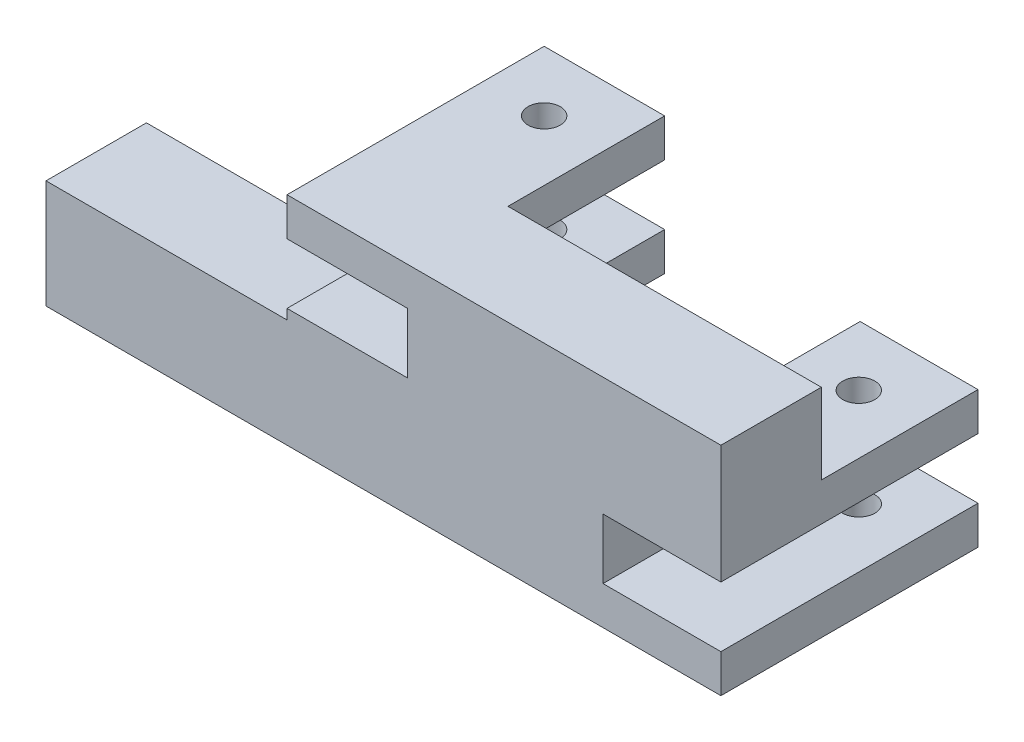
ISO-10303-21;
HEADER;
FILE_DESCRIPTION(('STEP AP214'),'2;1');
FILE_NAME('part.step','',(''),(''),'','','');
FILE_SCHEMA(('AUTOMOTIVE_DESIGN { 1 0 10303 214 1 1 1 1 }'));
ENDSEC;
DATA;
#1=APPLICATION_CONTEXT('core data for automotive mechanical design processes');
#2=APPLICATION_PROTOCOL_DEFINITION('international standard','automotive_design',2000,#1);
#3=PRODUCT_CONTEXT('',#1,'mechanical');
#4=PRODUCT('Part','Part','',(#3));
#5=PRODUCT_RELATED_PRODUCT_CATEGORY('part','',(#4));
#6=PRODUCT_DEFINITION_FORMATION('','',#4);
#7=PRODUCT_DEFINITION_CONTEXT('part definition',#1,'design');
#8=PRODUCT_DEFINITION('design','',#6,#7);
#9=PRODUCT_DEFINITION_SHAPE('','',#8);
#10=(LENGTH_UNIT() NAMED_UNIT(*) SI_UNIT(.MILLI.,.METRE.));
#11=(NAMED_UNIT(*) PLANE_ANGLE_UNIT() SI_UNIT($,.RADIAN.));
#12=(NAMED_UNIT(*) SI_UNIT($,.STERADIAN.) SOLID_ANGLE_UNIT());
#13=UNCERTAINTY_MEASURE_WITH_UNIT(LENGTH_MEASURE(1.E-05),#10,'distance_accuracy_value','');
#14=(GEOMETRIC_REPRESENTATION_CONTEXT(3) GLOBAL_UNCERTAINTY_ASSIGNED_CONTEXT((#13)) GLOBAL_UNIT_ASSIGNED_CONTEXT((#10,
#11,#12)) REPRESENTATION_CONTEXT('',''));
#15=CARTESIAN_POINT('',(0.,0.,0.));
#16=DIRECTION('',(0.,0.,1.));
#17=DIRECTION('',(1.,0.,0.));
#18=AXIS2_PLACEMENT_3D('',#15,#16,#17);
#19=CARTESIAN_POINT('',(-54.,-27.,25.));
#20=DIRECTION('',(1.,0.,0.));
#21=DIRECTION('',(0.,1.,0.));
#22=AXIS2_PLACEMENT_3D('',#19,#20,#21);
#23=PLANE('',#22);
#24=DIRECTION('',(0.,0.,-1.));
#25=VECTOR('',#24,1.);
#26=CARTESIAN_POINT('',(-54.,0.,25.));
#27=LINE('',#26,#25);
#28=CARTESIAN_POINT('',(-54.,0.,25.));
#29=VERTEX_POINT('',#28);
#30=CARTESIAN_POINT('',(-54.,0.,0.));
#31=VERTEX_POINT('',#30);
#32=EDGE_CURVE('E536',#29,#31,#27,.T.);
#33=ORIENTED_EDGE('',*,*,#32,.F.);
#34=DIRECTION('',(0.,-1.,0.));
#35=VECTOR('',#34,1.);
#36=CARTESIAN_POINT('',(-54.,-27.,25.));
#37=LINE('',#36,#35);
#38=CARTESIAN_POINT('',(-54.,2.5,25.));
#39=VERTEX_POINT('',#38);
#40=EDGE_CURVE('E371',#39,#29,#37,.T.);
#41=ORIENTED_EDGE('',*,*,#40,.F.);
#42=DIRECTION('',(0.,0.,-1.));
#43=VECTOR('',#42,1.);
#44=CARTESIAN_POINT('',(-54.,2.5,25.));
#45=LINE('',#44,#43);
#46=CARTESIAN_POINT('',(-54.,2.5,-39.));
#47=VERTEX_POINT('',#46);
#48=EDGE_CURVE('E192',#39,#47,#45,.T.);
#49=ORIENTED_EDGE('',*,*,#48,.T.);
#50=DIRECTION('',(0.,1.,0.));
#51=VECTOR('',#50,1.);
#52=CARTESIAN_POINT('',(-54.,2.5,-39.));
#53=LINE('',#52,#51);
#54=CARTESIAN_POINT('',(-54.,-7.,-39.));
#55=VERTEX_POINT('',#54);
#56=EDGE_CURVE('E278',#55,#47,#53,.T.);
#57=ORIENTED_EDGE('',*,*,#56,.F.);
#58=DIRECTION('',(0.,0.,1.));
#59=VECTOR('',#58,1.);
#60=CARTESIAN_POINT('',(-54.,-7.,-39.));
#61=LINE('',#60,#59);
#62=CARTESIAN_POINT('',(-54.,-7.,0.));
#63=VERTEX_POINT('',#62);
#64=EDGE_CURVE('E296',#55,#63,#61,.T.);
#65=ORIENTED_EDGE('',*,*,#64,.T.);
#66=DIRECTION('',(0.,-1.,0.));
#67=VECTOR('',#66,1.);
#68=CARTESIAN_POINT('',(-54.,-27.,0.));
#69=LINE('',#68,#67);
#70=EDGE_CURVE('E540',#31,#63,#69,.T.);
#71=ORIENTED_EDGE('',*,*,#70,.F.);
#72=EDGE_LOOP('',(#33,#41,#49,#57,#65,#71));
#73=FACE_BOUND('',#72,.T.);
#74=ADVANCED_FACE('F43',(#73),#23,.F.);
#75=CARTESIAN_POINT('',(0.,0.,0.));
#76=DIRECTION('',(0.,0.,-1.));
#77=DIRECTION('',(-1.,0.,0.));
#78=AXIS2_PLACEMENT_3D('',#75,#76,#77);
#79=PLANE('',#78);
#80=DIRECTION('',(0.,-1.,0.));
#81=VECTOR('',#80,1.);
#82=CARTESIAN_POINT('',(-24.,2.5,0.));
#83=LINE('',#82,#81);
#84=CARTESIAN_POINT('',(-24.,17.5,0.));
#85=VERTEX_POINT('',#84);
#86=CARTESIAN_POINT('',(-24.,2.5,0.));
#87=VERTEX_POINT('',#86);
#88=EDGE_CURVE('E153',#85,#87,#83,.T.);
#89=ORIENTED_EDGE('',*,*,#88,.F.);
#90=DIRECTION('',(0.,-1.,0.));
#91=VECTOR('',#90,1.);
#92=CARTESIAN_POINT('',(-24.,17.5,0.));
#93=LINE('',#92,#91);
#94=CARTESIAN_POINT('',(-24.,27.,0.));
#95=VERTEX_POINT('',#94);
#96=EDGE_CURVE('E240',#95,#85,#93,.T.);
#97=ORIENTED_EDGE('',*,*,#96,.F.);
#98=DIRECTION('',(-1.,0.,0.));
#99=VECTOR('',#98,1.);
#100=CARTESIAN_POINT('',(-54.,27.,0.));
#101=LINE('',#100,#99);
#102=CARTESIAN_POINT('',(54.,27.,0.));
#103=VERTEX_POINT('',#102);
#104=EDGE_CURVE('E168',#103,#95,#101,.T.);
#105=ORIENTED_EDGE('',*,*,#104,.F.);
#106=DIRECTION('',(0.,1.,0.));
#107=VECTOR('',#106,1.);
#108=CARTESIAN_POINT('',(54.,27.,0.));
#109=LINE('',#108,#107);
#110=CARTESIAN_POINT('',(54.,7.,0.));
#111=VERTEX_POINT('',#110);
#112=EDGE_CURVE('E61',#111,#103,#109,.T.);
#113=ORIENTED_EDGE('',*,*,#112,.F.);
#114=DIRECTION('',(1.,0.,0.));
#115=VECTOR('',#114,1.);
#116=CARTESIAN_POINT('',(54.,7.,0.));
#117=LINE('',#116,#115);
#118=CARTESIAN_POINT('',(24.6546989048147,7.,0.));
#119=VERTEX_POINT('',#118);
#120=EDGE_CURVE('E335',#119,#111,#117,.T.);
#121=ORIENTED_EDGE('',*,*,#120,.F.);
#122=DIRECTION('',(0.,1.,0.));
#123=VECTOR('',#122,1.);
#124=CARTESIAN_POINT('',(24.6546989048147,7.,0.));
#125=LINE('',#124,#123);
#126=CARTESIAN_POINT('',(24.6546989048147,-2.5,0.));
#127=VERTEX_POINT('',#126);
#128=EDGE_CURVE('E331',#127,#119,#125,.T.);
#129=ORIENTED_EDGE('',*,*,#128,.F.);
#130=DIRECTION('',(0.,1.,0.));
#131=VECTOR('',#130,1.);
#132=CARTESIAN_POINT('',(24.6546989048147,-2.5,0.));
#133=LINE('',#132,#131);
#134=CARTESIAN_POINT('',(24.6546989048147,-17.5,0.));
#135=VERTEX_POINT('',#134);
#136=EDGE_CURVE('E162',#135,#127,#133,.T.);
#137=ORIENTED_EDGE('',*,*,#136,.F.);
#138=DIRECTION('',(0.,1.,0.));
#139=VECTOR('',#138,1.);
#140=CARTESIAN_POINT('',(24.6546989048147,-17.5,0.));
#141=LINE('',#140,#139);
#142=CARTESIAN_POINT('',(24.6546989048147,-27.,0.));
#143=VERTEX_POINT('',#142);
#144=EDGE_CURVE('E304',#143,#135,#141,.T.);
#145=ORIENTED_EDGE('',*,*,#144,.F.);
#146=DIRECTION('',(1.,0.,0.));
#147=VECTOR('',#146,1.);
#148=CARTESIAN_POINT('',(54.,-27.,0.));
#149=LINE('',#148,#147);
#150=CARTESIAN_POINT('',(-114.,-27.,0.));
#151=VERTEX_POINT('',#150);
#152=EDGE_CURVE('E157',#151,#143,#149,.T.);
#153=ORIENTED_EDGE('',*,*,#152,.F.);
#154=DIRECTION('',(0.,-1.,0.));
#155=VECTOR('',#154,1.);
#156=CARTESIAN_POINT('',(-114.,-27.,0.));
#157=LINE('',#156,#155);
#158=CARTESIAN_POINT('',(-114.,0.,0.));
#159=VERTEX_POINT('',#158);
#160=EDGE_CURVE('E527',#159,#151,#157,.T.);
#161=ORIENTED_EDGE('',*,*,#160,.F.);
#162=DIRECTION('',(1.,0.,0.));
#163=VECTOR('',#162,1.);
#164=CARTESIAN_POINT('',(-114.,0.,0.));
#165=LINE('',#164,#163);
#166=EDGE_CURVE('E221',#159,#31,#165,.T.);
#167=ORIENTED_EDGE('',*,*,#166,.T.);
#168=ORIENTED_EDGE('',*,*,#70,.T.);
#169=DIRECTION('',(-1.,0.,0.));
#170=VECTOR('',#169,1.);
#171=CARTESIAN_POINT('',(-24.,-7.,0.));
#172=LINE('',#171,#170);
#173=CARTESIAN_POINT('',(-24.,-7.,0.));
#174=VERTEX_POINT('',#173);
#175=EDGE_CURVE('E274',#174,#63,#172,.T.);
#176=ORIENTED_EDGE('',*,*,#175,.F.);
#177=DIRECTION('',(0.,-1.,0.));
#178=VECTOR('',#177,1.);
#179=CARTESIAN_POINT('',(-24.,2.5,0.));
#180=LINE('',#179,#178);
#181=EDGE_CURVE('E268',#87,#174,#180,.T.);
#182=ORIENTED_EDGE('',*,*,#181,.F.);
#183=EDGE_LOOP('',(#89,#97,#105,#113,#121,#129,#137,#145,#153,#161,#167,#168,#176,#182));
#184=FACE_BOUND('',#183,.T.);
#185=ADVANCED_FACE('F413',(#184),#79,.T.);
#186=CARTESIAN_POINT('',(-54.,17.5,25.));
#187=DIRECTION('',(1.,0.,0.));
#188=DIRECTION('',(0.,0.,-1.));
#189=AXIS2_PLACEMENT_3D('',#186,#187,#188);
#190=PLANE('',#189);
#191=DIRECTION('',(0.,0.,-1.));
#192=VECTOR('',#191,1.);
#193=CARTESIAN_POINT('',(-54.,27.,25.));
#194=LINE('',#193,#192);
#195=CARTESIAN_POINT('',(-54.,27.,25.));
#196=VERTEX_POINT('',#195);
#197=CARTESIAN_POINT('',(-54.,27.,-39.));
#198=VERTEX_POINT('',#197);
#199=EDGE_CURVE('E149',#196,#198,#194,.T.);
#200=ORIENTED_EDGE('',*,*,#199,.T.);
#201=DIRECTION('',(0.,1.,0.));
#202=VECTOR('',#201,1.);
#203=CARTESIAN_POINT('',(-54.,17.5,-39.));
#204=LINE('',#203,#202);
#205=CARTESIAN_POINT('',(-54.,17.5,-39.));
#206=VERTEX_POINT('',#205);
#207=EDGE_CURVE('E241',#206,#198,#204,.T.);
#208=ORIENTED_EDGE('',*,*,#207,.F.);
#209=DIRECTION('',(0.,0.,-1.));
#210=VECTOR('',#209,1.);
#211=CARTESIAN_POINT('',(-54.,17.5,25.));
#212=LINE('',#211,#210);
#213=CARTESIAN_POINT('',(-54.,17.5,25.));
#214=VERTEX_POINT('',#213);
#215=EDGE_CURVE('E14',#214,#206,#212,.T.);
#216=ORIENTED_EDGE('',*,*,#215,.F.);
#217=DIRECTION('',(0.,-1.,0.));
#218=VECTOR('',#217,1.);
#219=CARTESIAN_POINT('',(-54.,17.5,25.));
#220=LINE('',#219,#218);
#221=EDGE_CURVE('E172',#196,#214,#220,.T.);
#222=ORIENTED_EDGE('',*,*,#221,.F.);
#223=EDGE_LOOP('',(#200,#208,#216,#222));
#224=FACE_BOUND('',#223,.T.);
#225=ADVANCED_FACE('F45',(#224),#190,.F.);
#226=CARTESIAN_POINT('',(-24.,17.5,25.));
#227=DIRECTION('',(0.,1.,0.));
#228=DIRECTION('',(0.,0.,1.));
#229=AXIS2_PLACEMENT_3D('',#226,#227,#228);
#230=PLANE('',#229);
#231=CARTESIAN_POINT('',(-39.,17.5,-24.));
#232=DIRECTION('',(0.,1.,0.));
#233=DIRECTION('',(0.,0.,1.));
#234=AXIS2_PLACEMENT_3D('',#231,#232,#233);
#235=CIRCLE('',#234,4.);
#236=CARTESIAN_POINT('',(-39.,17.5,-20.));
#237=VERTEX_POINT('',#236);
#238=EDGE_CURVE('E212',#237,#237,#235,.T.);
#239=ORIENTED_EDGE('',*,*,#238,.T.);
#240=EDGE_LOOP('',(#239));
#241=FACE_BOUND('',#240,.T.);
#242=ORIENTED_EDGE('',*,*,#215,.T.);
#243=DIRECTION('',(-1.,0.,0.));
#244=VECTOR('',#243,1.);
#245=CARTESIAN_POINT('',(-54.,17.5,-39.));
#246=LINE('',#245,#244);
#247=CARTESIAN_POINT('',(-24.,17.5,-39.));
#248=VERTEX_POINT('',#247);
#249=EDGE_CURVE('E253',#248,#206,#246,.T.);
#250=ORIENTED_EDGE('',*,*,#249,.F.);
#251=DIRECTION('',(0.,0.,1.));
#252=VECTOR('',#251,1.);
#253=CARTESIAN_POINT('',(-24.,17.5,-39.));
#254=LINE('',#253,#252);
#255=EDGE_CURVE('E257',#248,#85,#254,.T.);
#256=ORIENTED_EDGE('',*,*,#255,.T.);
#257=DIRECTION('',(0.,0.,-1.));
#258=VECTOR('',#257,1.);
#259=CARTESIAN_POINT('',(-24.,17.5,25.));
#260=LINE('',#259,#258);
#261=CARTESIAN_POINT('',(-24.,17.5,25.));
#262=VERTEX_POINT('',#261);
#263=EDGE_CURVE('E53',#262,#85,#260,.T.);
#264=ORIENTED_EDGE('',*,*,#263,.F.);
#265=DIRECTION('',(1.,0.,0.));
#266=VECTOR('',#265,1.);
#267=CARTESIAN_POINT('',(-24.,17.5,25.));
#268=LINE('',#267,#266);
#269=EDGE_CURVE('E94',#214,#262,#268,.T.);
#270=ORIENTED_EDGE('',*,*,#269,.F.);
#271=EDGE_LOOP('',(#242,#250,#256,#264,#270));
#272=FACE_BOUND('',#271,.T.);
#273=ADVANCED_FACE('F431',(#241,#272),#230,.F.);
#274=CARTESIAN_POINT('',(-24.,2.5,25.));
#275=DIRECTION('',(1.,0.,0.));
#276=DIRECTION('',(0.,1.,0.));
#277=AXIS2_PLACEMENT_3D('',#274,#275,#276);
#278=PLANE('',#277);
#279=ORIENTED_EDGE('',*,*,#88,.T.);
#280=DIRECTION('',(0.,0.,-1.));
#281=VECTOR('',#280,1.);
#282=CARTESIAN_POINT('',(-24.,2.5,25.));
#283=LINE('',#282,#281);
#284=CARTESIAN_POINT('',(-24.,2.5,25.));
#285=VERTEX_POINT('',#284);
#286=EDGE_CURVE('E196',#285,#87,#283,.T.);
#287=ORIENTED_EDGE('',*,*,#286,.F.);
#288=DIRECTION('',(0.,-1.,0.));
#289=VECTOR('',#288,1.);
#290=CARTESIAN_POINT('',(-24.,2.5,25.));
#291=LINE('',#290,#289);
#292=EDGE_CURVE('E365',#262,#285,#291,.T.);
#293=ORIENTED_EDGE('',*,*,#292,.F.);
#294=ORIENTED_EDGE('',*,*,#263,.T.);
#295=EDGE_LOOP('',(#279,#287,#293,#294));
#296=FACE_BOUND('',#295,.T.);
#297=ADVANCED_FACE('F428',(#296),#278,.F.);
#298=CARTESIAN_POINT('',(-54.,2.5,25.));
#299=DIRECTION('',(0.,-1.,0.));
#300=DIRECTION('',(1.,0.,0.));
#301=AXIS2_PLACEMENT_3D('',#298,#299,#300);
#302=PLANE('',#301);
#303=CARTESIAN_POINT('',(-39.,2.5,-24.));
#304=DIRECTION('',(0.,-1.,0.));
#305=DIRECTION('',(1.,0.,0.));
#306=AXIS2_PLACEMENT_3D('',#303,#304,#305);
#307=CIRCLE('',#306,4.);
#308=CARTESIAN_POINT('',(-35.,2.5,-24.));
#309=VERTEX_POINT('',#308);
#310=EDGE_CURVE('E205',#309,#309,#307,.T.);
#311=ORIENTED_EDGE('',*,*,#310,.T.);
#312=EDGE_LOOP('',(#311));
#313=FACE_BOUND('',#312,.T.);
#314=ORIENTED_EDGE('',*,*,#286,.T.);
#315=DIRECTION('',(0.,0.,1.));
#316=VECTOR('',#315,1.);
#317=CARTESIAN_POINT('',(-24.,2.5,-39.));
#318=LINE('',#317,#316);
#319=CARTESIAN_POINT('',(-24.,2.5,-39.));
#320=VERTEX_POINT('',#319);
#321=EDGE_CURVE('E286',#320,#87,#318,.T.);
#322=ORIENTED_EDGE('',*,*,#321,.F.);
#323=DIRECTION('',(1.,0.,0.));
#324=VECTOR('',#323,1.);
#325=CARTESIAN_POINT('',(-24.,2.5,-39.));
#326=LINE('',#325,#324);
#327=EDGE_CURVE('E282',#47,#320,#326,.T.);
#328=ORIENTED_EDGE('',*,*,#327,.F.);
#329=ORIENTED_EDGE('',*,*,#48,.F.);
#330=DIRECTION('',(-1.,0.,0.));
#331=VECTOR('',#330,1.);
#332=CARTESIAN_POINT('',(-54.,2.5,25.));
#333=LINE('',#332,#331);
#334=EDGE_CURVE('E368',#285,#39,#333,.T.);
#335=ORIENTED_EDGE('',*,*,#334,.F.);
#336=EDGE_LOOP('',(#314,#322,#328,#329,#335));
#337=FACE_BOUND('',#336,.T.);
#338=ADVANCED_FACE('F425',(#313,#337),#302,.F.);
#339=CARTESIAN_POINT('',(54.,-27.,25.));
#340=DIRECTION('',(0.,1.,0.));
#341=DIRECTION('',(0.,0.,1.));
#342=AXIS2_PLACEMENT_3D('',#339,#340,#341);
#343=PLANE('',#342);
#344=CARTESIAN_POINT('',(39.3273494524073,-27.,-24.));
#345=DIRECTION('',(0.,1.,0.));
#346=DIRECTION('',(0.,0.,1.));
#347=AXIS2_PLACEMENT_3D('',#344,#345,#346);
#348=CIRCLE('',#347,4.00000000000001);
#349=CARTESIAN_POINT('',(39.3273494524073,-27.,-20.));
#350=VERTEX_POINT('',#349);
#351=EDGE_CURVE('E236',#350,#350,#348,.T.);
#352=ORIENTED_EDGE('',*,*,#351,.T.);
#353=EDGE_LOOP('',(#352));
#354=FACE_BOUND('',#353,.T.);
#355=ORIENTED_EDGE('',*,*,#152,.T.);
#356=DIRECTION('',(0.,0.,1.));
#357=VECTOR('',#356,1.);
#358=CARTESIAN_POINT('',(24.6546989048147,-27.,-39.));
#359=LINE('',#358,#357);
#360=CARTESIAN_POINT('',(24.6546989048147,-27.,-39.));
#361=VERTEX_POINT('',#360);
#362=EDGE_CURVE('E327',#361,#143,#359,.T.);
#363=ORIENTED_EDGE('',*,*,#362,.F.);
#364=DIRECTION('',(-1.,0.,0.));
#365=VECTOR('',#364,1.);
#366=CARTESIAN_POINT('',(54.,-27.,-39.));
#367=LINE('',#366,#365);
#368=CARTESIAN_POINT('',(54.,-27.,-39.));
#369=VERTEX_POINT('',#368);
#370=EDGE_CURVE('E309',#369,#361,#367,.T.);
#371=ORIENTED_EDGE('',*,*,#370,.F.);
#372=DIRECTION('',(0.,0.,-1.));
#373=VECTOR('',#372,1.);
#374=CARTESIAN_POINT('',(54.,-27.,25.));
#375=LINE('',#374,#373);
#376=CARTESIAN_POINT('',(54.,-27.,25.));
#377=VERTEX_POINT('',#376);
#378=EDGE_CURVE('E188',#377,#369,#375,.T.);
#379=ORIENTED_EDGE('',*,*,#378,.F.);
#380=DIRECTION('',(1.,0.,0.));
#381=VECTOR('',#380,1.);
#382=CARTESIAN_POINT('',(54.,-27.,25.));
#383=LINE('',#382,#381);
#384=CARTESIAN_POINT('',(-114.,-27.,25.));
#385=VERTEX_POINT('',#384);
#386=EDGE_CURVE('E375',#385,#377,#383,.T.);
#387=ORIENTED_EDGE('',*,*,#386,.F.);
#388=DIRECTION('',(0.,0.,1.));
#389=VECTOR('',#388,1.);
#390=CARTESIAN_POINT('',(-114.,-27.,25.));
#391=LINE('',#390,#389);
#392=EDGE_CURVE('E518',#151,#385,#391,.T.);
#393=ORIENTED_EDGE('',*,*,#392,.F.);
#394=EDGE_LOOP('',(#355,#363,#371,#379,#387,#393));
#395=FACE_BOUND('',#394,.T.);
#396=ADVANCED_FACE('F423',(#354,#395),#343,.F.);
#397=CARTESIAN_POINT('',(54.,-17.5,25.));
#398=DIRECTION('',(-1.,0.,0.));
#399=DIRECTION('',(0.,-1.,0.));
#400=AXIS2_PLACEMENT_3D('',#397,#398,#399);
#401=PLANE('',#400);
#402=ORIENTED_EDGE('',*,*,#378,.T.);
#403=DIRECTION('',(0.,-1.,0.));
#404=VECTOR('',#403,1.);
#405=CARTESIAN_POINT('',(54.,-17.5,-39.));
#406=LINE('',#405,#404);
#407=CARTESIAN_POINT('',(54.,-17.5,-39.));
#408=VERTEX_POINT('',#407);
#409=EDGE_CURVE('E305',#408,#369,#406,.T.);
#410=ORIENTED_EDGE('',*,*,#409,.F.);
#411=DIRECTION('',(0.,0.,-1.));
#412=VECTOR('',#411,1.);
#413=CARTESIAN_POINT('',(54.,-17.5,25.));
#414=LINE('',#413,#412);
#415=CARTESIAN_POINT('',(54.,-17.5,25.));
#416=VERTEX_POINT('',#415);
#417=EDGE_CURVE('E184',#416,#408,#414,.T.);
#418=ORIENTED_EDGE('',*,*,#417,.F.);
#419=DIRECTION('',(0.,1.,0.));
#420=VECTOR('',#419,1.);
#421=CARTESIAN_POINT('',(54.,-17.5,25.));
#422=LINE('',#421,#420);
#423=EDGE_CURVE('E378',#377,#416,#422,.T.);
#424=ORIENTED_EDGE('',*,*,#423,.F.);
#425=EDGE_LOOP('',(#402,#410,#418,#424));
#426=FACE_BOUND('',#425,.T.);
#427=ADVANCED_FACE('F691',(#426),#401,.F.);
#428=CARTESIAN_POINT('',(24.6546989048147,-17.5,25.));
#429=DIRECTION('',(0.,-1.,0.));
#430=DIRECTION('',(0.,0.,-1.));
#431=AXIS2_PLACEMENT_3D('',#428,#429,#430);
#432=PLANE('',#431);
#433=CARTESIAN_POINT('',(39.3273494524073,-17.5,-24.));
#434=DIRECTION('',(0.,-1.,0.));
#435=DIRECTION('',(0.,0.,-1.));
#436=AXIS2_PLACEMENT_3D('',#433,#434,#435);
#437=CIRCLE('',#436,4.00000000000001);
#438=CARTESIAN_POINT('',(39.3273494524073,-17.5,-28.));
#439=VERTEX_POINT('',#438);
#440=EDGE_CURVE('E232',#439,#439,#437,.T.);
#441=ORIENTED_EDGE('',*,*,#440,.T.);
#442=EDGE_LOOP('',(#441));
#443=FACE_BOUND('',#442,.T.);
#444=ORIENTED_EDGE('',*,*,#417,.T.);
#445=DIRECTION('',(1.,0.,0.));
#446=VECTOR('',#445,1.);
#447=CARTESIAN_POINT('',(54.,-17.5,-39.));
#448=LINE('',#447,#446);
#449=CARTESIAN_POINT('',(24.6546989048147,-17.5,-39.));
#450=VERTEX_POINT('',#449);
#451=EDGE_CURVE('E317',#450,#408,#448,.T.);
#452=ORIENTED_EDGE('',*,*,#451,.F.);
#453=DIRECTION('',(0.,0.,1.));
#454=VECTOR('',#453,1.);
#455=CARTESIAN_POINT('',(24.6546989048147,-17.5,-39.));
#456=LINE('',#455,#454);
#457=EDGE_CURVE('E321',#450,#135,#456,.T.);
#458=ORIENTED_EDGE('',*,*,#457,.T.);
#459=DIRECTION('',(0.,0.,-1.));
#460=VECTOR('',#459,1.);
#461=CARTESIAN_POINT('',(24.6546989048147,-17.5,25.));
#462=LINE('',#461,#460);
#463=CARTESIAN_POINT('',(24.6546989048147,-17.5,25.));
#464=VERTEX_POINT('',#463);
#465=EDGE_CURVE('E180',#464,#135,#462,.T.);
#466=ORIENTED_EDGE('',*,*,#465,.F.);
#467=DIRECTION('',(-1.,0.,0.));
#468=VECTOR('',#467,1.);
#469=CARTESIAN_POINT('',(24.6546989048147,-17.5,25.));
#470=LINE('',#469,#468);
#471=EDGE_CURVE('E381',#416,#464,#470,.T.);
#472=ORIENTED_EDGE('',*,*,#471,.F.);
#473=EDGE_LOOP('',(#444,#452,#458,#466,#472));
#474=FACE_BOUND('',#473,.T.);
#475=ADVANCED_FACE('F409',(#443,#474),#432,.F.);
#476=CARTESIAN_POINT('',(24.6546989048147,-2.5,25.));
#477=DIRECTION('',(-1.,0.,0.));
#478=DIRECTION('',(0.,-1.,0.));
#479=AXIS2_PLACEMENT_3D('',#476,#477,#478);
#480=PLANE('',#479);
#481=ORIENTED_EDGE('',*,*,#136,.T.);
#482=DIRECTION('',(0.,0.,-1.));
#483=VECTOR('',#482,1.);
#484=CARTESIAN_POINT('',(24.6546989048147,-2.5,25.));
#485=LINE('',#484,#483);
#486=CARTESIAN_POINT('',(24.6546989048147,-2.5,25.));
#487=VERTEX_POINT('',#486);
#488=EDGE_CURVE('E142',#487,#127,#485,.T.);
#489=ORIENTED_EDGE('',*,*,#488,.F.);
#490=DIRECTION('',(0.,1.,0.));
#491=VECTOR('',#490,1.);
#492=CARTESIAN_POINT('',(24.6546989048147,-2.5,25.));
#493=LINE('',#492,#491);
#494=EDGE_CURVE('E125',#464,#487,#493,.T.);
#495=ORIENTED_EDGE('',*,*,#494,.F.);
#496=ORIENTED_EDGE('',*,*,#465,.T.);
#497=EDGE_LOOP('',(#481,#489,#495,#496));
#498=FACE_BOUND('',#497,.T.);
#499=ADVANCED_FACE('F401',(#498),#480,.F.);
#500=CARTESIAN_POINT('',(54.,-2.5,25.));
#501=DIRECTION('',(0.,1.,0.));
#502=DIRECTION('',(-1.,0.,0.));
#503=AXIS2_PLACEMENT_3D('',#500,#501,#502);
#504=PLANE('',#503);
#505=CARTESIAN_POINT('',(39.3273494524073,-2.5,-24.));
#506=DIRECTION('',(0.,1.,0.));
#507=DIRECTION('',(-1.,0.,0.));
#508=AXIS2_PLACEMENT_3D('',#505,#506,#507);
#509=CIRCLE('',#508,4.00000000000001);
#510=CARTESIAN_POINT('',(35.3273494524073,-2.5,-24.));
#511=VERTEX_POINT('',#510);
#512=EDGE_CURVE('E228',#511,#511,#509,.T.);
#513=ORIENTED_EDGE('',*,*,#512,.T.);
#514=EDGE_LOOP('',(#513));
#515=FACE_BOUND('',#514,.T.);
#516=ORIENTED_EDGE('',*,*,#488,.T.);
#517=DIRECTION('',(0.,0.,1.));
#518=VECTOR('',#517,1.);
#519=CARTESIAN_POINT('',(24.6546989048147,-2.5,-39.));
#520=LINE('',#519,#518);
#521=CARTESIAN_POINT('',(24.6546989048147,-2.5,-39.));
#522=VERTEX_POINT('',#521);
#523=EDGE_CURVE('E158',#522,#127,#520,.T.);
#524=ORIENTED_EDGE('',*,*,#523,.F.);
#525=DIRECTION('',(-1.,0.,0.));
#526=VECTOR('',#525,1.);
#527=CARTESIAN_POINT('',(54.,-2.5,-39.));
#528=LINE('',#527,#526);
#529=CARTESIAN_POINT('',(54.,-2.5,-39.));
#530=VERTEX_POINT('',#529);
#531=EDGE_CURVE('E138',#530,#522,#528,.T.);
#532=ORIENTED_EDGE('',*,*,#531,.F.);
#533=DIRECTION('',(0.,0.,-1.));
#534=VECTOR('',#533,1.);
#535=CARTESIAN_POINT('',(54.,-2.5,25.));
#536=LINE('',#535,#534);
#537=CARTESIAN_POINT('',(54.,-2.5,25.));
#538=VERTEX_POINT('',#537);
#539=EDGE_CURVE('E133',#538,#530,#536,.T.);
#540=ORIENTED_EDGE('',*,*,#539,.F.);
#541=DIRECTION('',(1.,0.,0.));
#542=VECTOR('',#541,1.);
#543=CARTESIAN_POINT('',(54.,-2.5,25.));
#544=LINE('',#543,#542);
#545=EDGE_CURVE('E119',#487,#538,#544,.T.);
#546=ORIENTED_EDGE('',*,*,#545,.F.);
#547=EDGE_LOOP('',(#516,#524,#532,#540,#546));
#548=FACE_BOUND('',#547,.T.);
#549=ADVANCED_FACE('F134',(#515,#548),#504,.F.);
#550=CARTESIAN_POINT('',(54.,27.,25.));
#551=DIRECTION('',(-1.,0.,0.));
#552=DIRECTION('',(0.,-1.,0.));
#553=AXIS2_PLACEMENT_3D('',#550,#551,#552);
#554=PLANE('',#553);
#555=ORIENTED_EDGE('',*,*,#539,.T.);
#556=DIRECTION('',(0.,-1.,0.));
#557=VECTOR('',#556,1.);
#558=CARTESIAN_POINT('',(54.,7.,-39.));
#559=LINE('',#558,#557);
#560=CARTESIAN_POINT('',(54.,7.,-39.));
#561=VERTEX_POINT('',#560);
#562=EDGE_CURVE('E332',#561,#530,#559,.T.);
#563=ORIENTED_EDGE('',*,*,#562,.F.);
#564=DIRECTION('',(0.,0.,1.));
#565=VECTOR('',#564,1.);
#566=CARTESIAN_POINT('',(54.,7.,-39.));
#567=LINE('',#566,#565);
#568=EDGE_CURVE('E346',#561,#111,#567,.T.);
#569=ORIENTED_EDGE('',*,*,#568,.T.);
#570=ORIENTED_EDGE('',*,*,#112,.T.);
#571=DIRECTION('',(0.,0.,-1.));
#572=VECTOR('',#571,1.);
#573=CARTESIAN_POINT('',(54.,27.,25.));
#574=LINE('',#573,#572);
#575=CARTESIAN_POINT('',(54.,27.,25.));
#576=VERTEX_POINT('',#575);
#577=EDGE_CURVE('E143',#576,#103,#574,.T.);
#578=ORIENTED_EDGE('',*,*,#577,.F.);
#579=DIRECTION('',(0.,1.,0.));
#580=VECTOR('',#579,1.);
#581=CARTESIAN_POINT('',(54.,27.,25.));
#582=LINE('',#581,#580);
#583=EDGE_CURVE('E123',#538,#576,#582,.T.);
#584=ORIENTED_EDGE('',*,*,#583,.F.);
#585=EDGE_LOOP('',(#555,#563,#569,#570,#578,#584));
#586=FACE_BOUND('',#585,.T.);
#587=ADVANCED_FACE('F145',(#586),#554,.F.);
#588=CARTESIAN_POINT('',(-54.,27.,25.));
#589=DIRECTION('',(0.,-1.,0.));
#590=DIRECTION('',(0.,0.,-1.));
#591=AXIS2_PLACEMENT_3D('',#588,#589,#590);
#592=PLANE('',#591);
#593=CARTESIAN_POINT('',(-39.,27.,-24.));
#594=DIRECTION('',(0.,1.,0.));
#595=DIRECTION('',(0.,0.,1.));
#596=AXIS2_PLACEMENT_3D('',#593,#594,#595);
#597=CIRCLE('',#596,4.);
#598=CARTESIAN_POINT('',(-39.,27.,-20.));
#599=VERTEX_POINT('',#598);
#600=EDGE_CURVE('E206',#599,#599,#597,.T.);
#601=ORIENTED_EDGE('',*,*,#600,.F.);
#602=EDGE_LOOP('',(#601));
#603=FACE_BOUND('',#602,.T.);
#604=ORIENTED_EDGE('',*,*,#104,.T.);
#605=DIRECTION('',(0.,0.,1.));
#606=VECTOR('',#605,1.);
#607=CARTESIAN_POINT('',(-24.,27.,-39.));
#608=LINE('',#607,#606);
#609=CARTESIAN_POINT('',(-24.,27.,-39.));
#610=VERTEX_POINT('',#609);
#611=EDGE_CURVE('E264',#610,#95,#608,.T.);
#612=ORIENTED_EDGE('',*,*,#611,.F.);
#613=DIRECTION('',(1.,0.,0.));
#614=VECTOR('',#613,1.);
#615=CARTESIAN_POINT('',(-54.,27.,-39.));
#616=LINE('',#615,#614);
#617=EDGE_CURVE('E245',#198,#610,#616,.T.);
#618=ORIENTED_EDGE('',*,*,#617,.F.);
#619=ORIENTED_EDGE('',*,*,#199,.F.);
#620=DIRECTION('',(-1.,0.,0.));
#621=VECTOR('',#620,1.);
#622=CARTESIAN_POINT('',(-54.,27.,25.));
#623=LINE('',#622,#621);
#624=EDGE_CURVE('E70',#576,#196,#623,.T.);
#625=ORIENTED_EDGE('',*,*,#624,.F.);
#626=ORIENTED_EDGE('',*,*,#577,.T.);
#627=EDGE_LOOP('',(#604,#612,#618,#619,#625,#626));
#628=FACE_BOUND('',#627,.T.);
#629=ADVANCED_FACE('F407',(#603,#628),#592,.F.);
#630=CARTESIAN_POINT('',(0.,0.,25.));
#631=DIRECTION('',(0.,0.,-1.));
#632=DIRECTION('',(-1.,0.,0.));
#633=AXIS2_PLACEMENT_3D('',#630,#631,#632);
#634=PLANE('',#633);
#635=ORIENTED_EDGE('',*,*,#221,.T.);
#636=ORIENTED_EDGE('',*,*,#269,.T.);
#637=ORIENTED_EDGE('',*,*,#292,.T.);
#638=ORIENTED_EDGE('',*,*,#334,.T.);
#639=ORIENTED_EDGE('',*,*,#40,.T.);
#640=DIRECTION('',(1.,0.,0.));
#641=VECTOR('',#640,1.);
#642=CARTESIAN_POINT('',(-114.,0.,25.));
#643=LINE('',#642,#641);
#644=CARTESIAN_POINT('',(-114.,0.,25.));
#645=VERTEX_POINT('',#644);
#646=EDGE_CURVE('E215',#645,#29,#643,.T.);
#647=ORIENTED_EDGE('',*,*,#646,.F.);
#648=DIRECTION('',(0.,1.,0.));
#649=VECTOR('',#648,1.);
#650=CARTESIAN_POINT('',(-114.,-27.,25.));
#651=LINE('',#650,#649);
#652=EDGE_CURVE('E543',#385,#645,#651,.T.);
#653=ORIENTED_EDGE('',*,*,#652,.F.);
#654=ORIENTED_EDGE('',*,*,#386,.T.);
#655=ORIENTED_EDGE('',*,*,#423,.T.);
#656=ORIENTED_EDGE('',*,*,#471,.T.);
#657=ORIENTED_EDGE('',*,*,#494,.T.);
#658=ORIENTED_EDGE('',*,*,#545,.T.);
#659=ORIENTED_EDGE('',*,*,#583,.T.);
#660=ORIENTED_EDGE('',*,*,#624,.T.);
#661=EDGE_LOOP('',(#635,#636,#637,#638,#639,#647,#653,#654,#655,#656,#657,#658,#659,#660));
#662=FACE_BOUND('',#661,.T.);
#663=ADVANCED_FACE('F121',(#662),#634,.F.);
#664=CARTESIAN_POINT('',(24.6546989048147,7.,-39.));
#665=DIRECTION('',(1.,0.,0.));
#666=DIRECTION('',(0.,1.,0.));
#667=AXIS2_PLACEMENT_3D('',#664,#665,#666);
#668=PLANE('',#667);
#669=ORIENTED_EDGE('',*,*,#128,.T.);
#670=DIRECTION('',(0.,0.,1.));
#671=VECTOR('',#670,1.);
#672=CARTESIAN_POINT('',(24.6546989048147,7.,-39.));
#673=LINE('',#672,#671);
#674=CARTESIAN_POINT('',(24.6546989048147,7.,-39.));
#675=VERTEX_POINT('',#674);
#676=EDGE_CURVE('E354',#675,#119,#673,.T.);
#677=ORIENTED_EDGE('',*,*,#676,.F.);
#678=DIRECTION('',(0.,1.,0.));
#679=VECTOR('',#678,1.);
#680=CARTESIAN_POINT('',(24.6546989048147,7.,-39.));
#681=LINE('',#680,#679);
#682=EDGE_CURVE('E338',#522,#675,#681,.T.);
#683=ORIENTED_EDGE('',*,*,#682,.F.);
#684=ORIENTED_EDGE('',*,*,#523,.T.);
#685=EDGE_LOOP('',(#669,#677,#683,#684));
#686=FACE_BOUND('',#685,.T.);
#687=ADVANCED_FACE('F502',(#686),#668,.F.);
#688=CARTESIAN_POINT('',(54.,7.,-39.));
#689=DIRECTION('',(0.,-1.,0.));
#690=DIRECTION('',(0.,0.,-1.));
#691=AXIS2_PLACEMENT_3D('',#688,#689,#690);
#692=PLANE('',#691);
#693=CARTESIAN_POINT('',(39.3273494524073,7.,-24.));
#694=DIRECTION('',(0.,-1.,0.));
#695=DIRECTION('',(0.,0.,-1.));
#696=AXIS2_PLACEMENT_3D('',#693,#694,#695);
#697=CIRCLE('',#696,4.00000000000001);
#698=CARTESIAN_POINT('',(39.3273494524073,7.,-28.));
#699=VERTEX_POINT('',#698);
#700=EDGE_CURVE('E47',#699,#699,#697,.T.);
#701=ORIENTED_EDGE('',*,*,#700,.T.);
#702=EDGE_LOOP('',(#701));
#703=FACE_BOUND('',#702,.T.);
#704=ORIENTED_EDGE('',*,*,#120,.T.);
#705=ORIENTED_EDGE('',*,*,#568,.F.);
#706=DIRECTION('',(1.,0.,0.));
#707=VECTOR('',#706,1.);
#708=CARTESIAN_POINT('',(54.,7.,-39.));
#709=LINE('',#708,#707);
#710=EDGE_CURVE('E342',#675,#561,#709,.T.);
#711=ORIENTED_EDGE('',*,*,#710,.F.);
#712=ORIENTED_EDGE('',*,*,#676,.T.);
#713=EDGE_LOOP('',(#704,#705,#711,#712));
#714=FACE_BOUND('',#713,.T.);
#715=ADVANCED_FACE('F388',(#703,#714),#692,.F.);
#716=CARTESIAN_POINT('',(0.,0.,-39.));
#717=DIRECTION('',(0.,0.,-1.));
#718=DIRECTION('',(-1.,0.,0.));
#719=AXIS2_PLACEMENT_3D('',#716,#717,#718);
#720=PLANE('',#719);
#721=ORIENTED_EDGE('',*,*,#562,.T.);
#722=ORIENTED_EDGE('',*,*,#531,.T.);
#723=ORIENTED_EDGE('',*,*,#682,.T.);
#724=ORIENTED_EDGE('',*,*,#710,.T.);
#725=EDGE_LOOP('',(#721,#722,#723,#724));
#726=FACE_BOUND('',#725,.T.);
#727=ADVANCED_FACE('F496',(#726),#720,.T.);
#728=CARTESIAN_POINT('',(24.6546989048147,-17.5,-39.));
#729=DIRECTION('',(1.,0.,0.));
#730=DIRECTION('',(0.,1.,0.));
#731=AXIS2_PLACEMENT_3D('',#728,#729,#730);
#732=PLANE('',#731);
#733=ORIENTED_EDGE('',*,*,#144,.T.);
#734=ORIENTED_EDGE('',*,*,#457,.F.);
#735=DIRECTION('',(0.,1.,0.));
#736=VECTOR('',#735,1.);
#737=CARTESIAN_POINT('',(24.6546989048147,-17.5,-39.));
#738=LINE('',#737,#736);
#739=EDGE_CURVE('E313',#361,#450,#738,.T.);
#740=ORIENTED_EDGE('',*,*,#739,.F.);
#741=ORIENTED_EDGE('',*,*,#362,.T.);
#742=EDGE_LOOP('',(#733,#734,#740,#741));
#743=FACE_BOUND('',#742,.T.);
#744=ADVANCED_FACE('F599',(#743),#732,.F.);
#745=CARTESIAN_POINT('',(0.,0.,-39.));
#746=DIRECTION('',(0.,0.,-1.));
#747=DIRECTION('',(-1.,0.,0.));
#748=AXIS2_PLACEMENT_3D('',#745,#746,#747);
#749=PLANE('',#748);
#750=ORIENTED_EDGE('',*,*,#409,.T.);
#751=ORIENTED_EDGE('',*,*,#370,.T.);
#752=ORIENTED_EDGE('',*,*,#739,.T.);
#753=ORIENTED_EDGE('',*,*,#451,.T.);
#754=EDGE_LOOP('',(#750,#751,#752,#753));
#755=FACE_BOUND('',#754,.T.);
#756=ADVANCED_FACE('F596',(#755),#749,.T.);
#757=CARTESIAN_POINT('',(-24.,2.5,-39.));
#758=DIRECTION('',(-1.,0.,0.));
#759=DIRECTION('',(0.,0.,1.));
#760=AXIS2_PLACEMENT_3D('',#757,#758,#759);
#761=PLANE('',#760);
#762=ORIENTED_EDGE('',*,*,#181,.T.);
#763=DIRECTION('',(0.,0.,1.));
#764=VECTOR('',#763,1.);
#765=CARTESIAN_POINT('',(-24.,-7.,-39.));
#766=LINE('',#765,#764);
#767=CARTESIAN_POINT('',(-24.,-7.,-39.));
#768=VERTEX_POINT('',#767);
#769=EDGE_CURVE('E300',#768,#174,#766,.T.);
#770=ORIENTED_EDGE('',*,*,#769,.F.);
#771=DIRECTION('',(0.,-1.,0.));
#772=VECTOR('',#771,1.);
#773=CARTESIAN_POINT('',(-24.,2.5,-39.));
#774=LINE('',#773,#772);
#775=EDGE_CURVE('E269',#320,#768,#774,.T.);
#776=ORIENTED_EDGE('',*,*,#775,.F.);
#777=ORIENTED_EDGE('',*,*,#321,.T.);
#778=EDGE_LOOP('',(#762,#770,#776,#777));
#779=FACE_BOUND('',#778,.T.);
#780=ADVANCED_FACE('F593',(#779),#761,.F.);
#781=CARTESIAN_POINT('',(-24.,-7.,-39.));
#782=DIRECTION('',(0.,1.,0.));
#783=DIRECTION('',(0.,0.,1.));
#784=AXIS2_PLACEMENT_3D('',#781,#782,#783);
#785=PLANE('',#784);
#786=CARTESIAN_POINT('',(-39.,-7.,-24.));
#787=DIRECTION('',(0.,1.,0.));
#788=DIRECTION('',(0.,0.,1.));
#789=AXIS2_PLACEMENT_3D('',#786,#787,#788);
#790=CIRCLE('',#789,4.);
#791=CARTESIAN_POINT('',(-39.,-7.,-20.));
#792=VERTEX_POINT('',#791);
#793=EDGE_CURVE('E202',#792,#792,#790,.T.);
#794=ORIENTED_EDGE('',*,*,#793,.T.);
#795=EDGE_LOOP('',(#794));
#796=FACE_BOUND('',#795,.T.);
#797=ORIENTED_EDGE('',*,*,#175,.T.);
#798=ORIENTED_EDGE('',*,*,#64,.F.);
#799=DIRECTION('',(-1.,0.,0.));
#800=VECTOR('',#799,1.);
#801=CARTESIAN_POINT('',(-24.,-7.,-39.));
#802=LINE('',#801,#800);
#803=EDGE_CURVE('E273',#768,#55,#802,.T.);
#804=ORIENTED_EDGE('',*,*,#803,.F.);
#805=ORIENTED_EDGE('',*,*,#769,.T.);
#806=EDGE_LOOP('',(#797,#798,#804,#805));
#807=FACE_BOUND('',#806,.T.);
#808=ADVANCED_FACE('F565',(#796,#807),#785,.F.);
#809=CARTESIAN_POINT('',(0.,0.,-39.));
#810=DIRECTION('',(0.,0.,-1.));
#811=DIRECTION('',(-1.,0.,0.));
#812=AXIS2_PLACEMENT_3D('',#809,#810,#811);
#813=PLANE('',#812);
#814=ORIENTED_EDGE('',*,*,#775,.T.);
#815=ORIENTED_EDGE('',*,*,#803,.T.);
#816=ORIENTED_EDGE('',*,*,#56,.T.);
#817=ORIENTED_EDGE('',*,*,#327,.T.);
#818=EDGE_LOOP('',(#814,#815,#816,#817));
#819=FACE_BOUND('',#818,.T.);
#820=ADVANCED_FACE('F581',(#819),#813,.T.);
#821=CARTESIAN_POINT('',(-24.,17.5,-39.));
#822=DIRECTION('',(-1.,0.,0.));
#823=DIRECTION('',(0.,-1.,0.));
#824=AXIS2_PLACEMENT_3D('',#821,#822,#823);
#825=PLANE('',#824);
#826=ORIENTED_EDGE('',*,*,#96,.T.);
#827=ORIENTED_EDGE('',*,*,#255,.F.);
#828=DIRECTION('',(0.,-1.,0.));
#829=VECTOR('',#828,1.);
#830=CARTESIAN_POINT('',(-24.,17.5,-39.));
#831=LINE('',#830,#829);
#832=EDGE_CURVE('E249',#610,#248,#831,.T.);
#833=ORIENTED_EDGE('',*,*,#832,.F.);
#834=ORIENTED_EDGE('',*,*,#611,.T.);
#835=EDGE_LOOP('',(#826,#827,#833,#834));
#836=FACE_BOUND('',#835,.T.);
#837=ADVANCED_FACE('F579',(#836),#825,.F.);
#838=CARTESIAN_POINT('',(0.,0.,-39.));
#839=DIRECTION('',(0.,0.,-1.));
#840=DIRECTION('',(-1.,0.,0.));
#841=AXIS2_PLACEMENT_3D('',#838,#839,#840);
#842=PLANE('',#841);
#843=ORIENTED_EDGE('',*,*,#207,.T.);
#844=ORIENTED_EDGE('',*,*,#617,.T.);
#845=ORIENTED_EDGE('',*,*,#832,.T.);
#846=ORIENTED_EDGE('',*,*,#249,.T.);
#847=EDGE_LOOP('',(#843,#844,#845,#846));
#848=FACE_BOUND('',#847,.T.);
#849=ADVANCED_FACE('F449',(#848),#842,.T.);
#850=CARTESIAN_POINT('',(-39.,-48.8137084989848,-24.));
#851=DIRECTION('',(0.,1.,0.));
#852=DIRECTION('',(0.,0.,1.));
#853=AXIS2_PLACEMENT_3D('',#850,#851,#852);
#854=CYLINDRICAL_SURFACE('',#853,4.);
#855=ORIENTED_EDGE('',*,*,#793,.F.);
#856=EDGE_LOOP('',(#855));
#857=FACE_BOUND('',#856,.T.);
#858=ORIENTED_EDGE('',*,*,#310,.F.);
#859=EDGE_LOOP('',(#858));
#860=FACE_BOUND('',#859,.T.);
#861=ADVANCED_FACE('F395',(#857,#860),#854,.F.);
#862=CARTESIAN_POINT('',(39.3273494524073,-48.8137084989848,-24.));
#863=DIRECTION('',(0.,1.,0.));
#864=DIRECTION('',(0.,0.,1.));
#865=AXIS2_PLACEMENT_3D('',#862,#863,#864);
#866=CYLINDRICAL_SURFACE('',#865,4.00000000000001);
#867=ORIENTED_EDGE('',*,*,#700,.F.);
#868=EDGE_LOOP('',(#867));
#869=FACE_BOUND('',#868,.T.);
#870=ORIENTED_EDGE('',*,*,#512,.F.);
#871=EDGE_LOOP('',(#870));
#872=FACE_BOUND('',#871,.T.);
#873=ADVANCED_FACE('F391',(#869,#872),#866,.F.);
#874=ORIENTED_EDGE('',*,*,#600,.T.);
#875=EDGE_LOOP('',(#874));
#876=FACE_BOUND('',#875,.T.);
#877=ORIENTED_EDGE('',*,*,#238,.F.);
#878=EDGE_LOOP('',(#877));
#879=FACE_BOUND('',#878,.T.);
#880=ADVANCED_FACE('F394',(#876,#879),#854,.F.);
#881=ORIENTED_EDGE('',*,*,#440,.F.);
#882=EDGE_LOOP('',(#881));
#883=FACE_BOUND('',#882,.T.);
#884=ORIENTED_EDGE('',*,*,#351,.F.);
#885=EDGE_LOOP('',(#884));
#886=FACE_BOUND('',#885,.T.);
#887=ADVANCED_FACE('F397',(#883,#886),#866,.F.);
#888=CARTESIAN_POINT('',(-114.,0.,25.));
#889=DIRECTION('',(0.,-1.,0.));
#890=DIRECTION('',(1.,0.,0.));
#891=AXIS2_PLACEMENT_3D('',#888,#889,#890);
#892=PLANE('',#891);
#893=ORIENTED_EDGE('',*,*,#32,.T.);
#894=ORIENTED_EDGE('',*,*,#166,.F.);
#895=DIRECTION('',(0.,0.,-1.));
#896=VECTOR('',#895,1.);
#897=CARTESIAN_POINT('',(-114.,0.,25.));
#898=LINE('',#897,#896);
#899=EDGE_CURVE('E532',#645,#159,#898,.T.);
#900=ORIENTED_EDGE('',*,*,#899,.F.);
#901=ORIENTED_EDGE('',*,*,#646,.T.);
#902=EDGE_LOOP('',(#893,#894,#900,#901));
#903=FACE_BOUND('',#902,.T.);
#904=ADVANCED_FACE('F557',(#903),#892,.F.);
#905=CARTESIAN_POINT('',(-114.,0.,0.));
#906=DIRECTION('',(-1.,0.,0.));
#907=DIRECTION('',(0.,-1.,0.));
#908=AXIS2_PLACEMENT_3D('',#905,#906,#907);
#909=PLANE('',#908);
#910=ORIENTED_EDGE('',*,*,#652,.T.);
#911=ORIENTED_EDGE('',*,*,#899,.T.);
#912=ORIENTED_EDGE('',*,*,#160,.T.);
#913=ORIENTED_EDGE('',*,*,#392,.T.);
#914=EDGE_LOOP('',(#910,#911,#912,#913));
#915=FACE_BOUND('',#914,.T.);
#916=ADVANCED_FACE('F554',(#915),#909,.T.);
#917=CLOSED_SHELL('',(#74,#185,#225,#273,#297,#338,#396,#427,#475,#499,#549,#587,#629,#663,#687,
#715,#727,#744,#756,#780,#808,#820,#837,#849,#861,#873,#880,#887,#904,#916));
#918=MANIFOLD_SOLID_BREP('B2',#917);
#919=ADVANCED_BREP_SHAPE_REPRESENTATION('',(#18,#918),#14);
#920=SHAPE_DEFINITION_REPRESENTATION(#9,#919);
ENDSEC;
END-ISO-10303-21;
